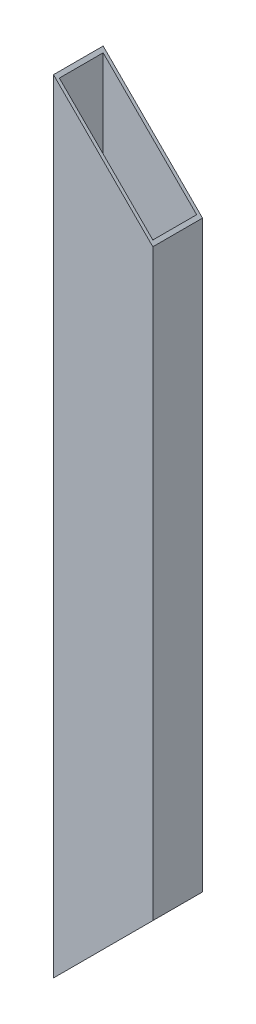
ISO-10303-21;
HEADER;
FILE_DESCRIPTION(('STEP AP214'),'2;1');
FILE_NAME('part.step','',(''),(''),'','','');
FILE_SCHEMA(('AUTOMOTIVE_DESIGN { 1 0 10303 214 1 1 1 1 }'));
ENDSEC;
DATA;
#1=APPLICATION_CONTEXT('core data for automotive mechanical design processes');
#2=APPLICATION_PROTOCOL_DEFINITION('international standard','automotive_design',2000,#1);
#3=PRODUCT_CONTEXT('',#1,'mechanical');
#4=PRODUCT('Part','Part','',(#3));
#5=PRODUCT_RELATED_PRODUCT_CATEGORY('part','',(#4));
#6=PRODUCT_DEFINITION_FORMATION('','',#4);
#7=PRODUCT_DEFINITION_CONTEXT('part definition',#1,'design');
#8=PRODUCT_DEFINITION('design','',#6,#7);
#9=PRODUCT_DEFINITION_SHAPE('','',#8);
#10=(LENGTH_UNIT() NAMED_UNIT(*) SI_UNIT(.MILLI.,.METRE.));
#11=(NAMED_UNIT(*) PLANE_ANGLE_UNIT() SI_UNIT($,.RADIAN.));
#12=(NAMED_UNIT(*) SI_UNIT($,.STERADIAN.) SOLID_ANGLE_UNIT());
#13=UNCERTAINTY_MEASURE_WITH_UNIT(LENGTH_MEASURE(1.E-05),#10,'distance_accuracy_value','');
#14=(GEOMETRIC_REPRESENTATION_CONTEXT(3) GLOBAL_UNCERTAINTY_ASSIGNED_CONTEXT((#13)) GLOBAL_UNIT_ASSIGNED_CONTEXT((#10,
#11,#12)) REPRESENTATION_CONTEXT('',''));
#15=CARTESIAN_POINT('',(0.,0.,0.));
#16=DIRECTION('',(0.,0.,1.));
#17=DIRECTION('',(1.,0.,0.));
#18=AXIS2_PLACEMENT_3D('',#15,#16,#17);
#19=CARTESIAN_POINT('',(25.4,400.,12.7));
#20=DIRECTION('',(-1.,0.,0.));
#21=DIRECTION('',(0.,0.,1.));
#22=AXIS2_PLACEMENT_3D('',#19,#20,#21);
#23=PLANE('',#22);
#24=DIRECTION('',(0.,-1.,0.));
#25=VECTOR('',#24,1.);
#26=CARTESIAN_POINT('',(25.4,400.,-12.7));
#27=LINE('',#26,#25);
#28=CARTESIAN_POINT('',(25.4,349.2,-12.7));
#29=VERTEX_POINT('',#28);
#30=CARTESIAN_POINT('',(25.4,50.8000000000002,-12.7));
#31=VERTEX_POINT('',#30);
#32=EDGE_CURVE('E107',#29,#31,#27,.T.);
#33=ORIENTED_EDGE('',*,*,#32,.F.);
#34=DIRECTION('',(0.,0.,1.));
#35=VECTOR('',#34,1.);
#36=CARTESIAN_POINT('',(25.4,349.2,-13.3));
#37=LINE('',#36,#35);
#38=CARTESIAN_POINT('',(25.4,349.2,12.7));
#39=VERTEX_POINT('',#38);
#40=EDGE_CURVE('E98',#29,#39,#37,.T.);
#41=ORIENTED_EDGE('',*,*,#40,.T.);
#42=DIRECTION('',(0.,-1.,0.));
#43=VECTOR('',#42,1.);
#44=CARTESIAN_POINT('',(25.4,400.,12.7));
#45=LINE('',#44,#43);
#46=CARTESIAN_POINT('',(25.4,50.8000000000002,12.7));
#47=VERTEX_POINT('',#46);
#48=EDGE_CURVE('E53',#39,#47,#45,.T.);
#49=ORIENTED_EDGE('',*,*,#48,.T.);
#50=DIRECTION('',(0.,0.,1.));
#51=VECTOR('',#50,1.);
#52=CARTESIAN_POINT('',(25.4,50.8000000000002,-13.3));
#53=LINE('',#52,#51);
#54=EDGE_CURVE('E166',#31,#47,#53,.T.);
#55=ORIENTED_EDGE('',*,*,#54,.F.);
#56=EDGE_LOOP('',(#33,#41,#49,#55));
#57=FACE_BOUND('',#56,.T.);
#58=ADVANCED_FACE('F32',(#57),#23,.F.);
#59=CARTESIAN_POINT('',(-25.4,400.,-12.7));
#60=DIRECTION('',(0.,0.,1.));
#61=DIRECTION('',(1.,0.,0.));
#62=AXIS2_PLACEMENT_3D('',#59,#60,#61);
#63=PLANE('',#62);
#64=DIRECTION('',(0.,-1.,0.));
#65=VECTOR('',#64,1.);
#66=CARTESIAN_POINT('',(-25.4,400.,-12.7));
#67=LINE('',#66,#65);
#68=CARTESIAN_POINT('',(-25.4,400.,-12.7));
#69=VERTEX_POINT('',#68);
#70=CARTESIAN_POINT('',(-25.4,0.,-12.7));
#71=VERTEX_POINT('',#70);
#72=EDGE_CURVE('E115',#69,#71,#67,.T.);
#73=ORIENTED_EDGE('',*,*,#72,.F.);
#74=DIRECTION('',(0.707106781186546,-0.707106781186549,0.));
#75=VECTOR('',#74,1.);
#76=CARTESIAN_POINT('',(-25.4,400.,-12.7));
#77=LINE('',#76,#75);
#78=EDGE_CURVE('E164',#69,#29,#77,.T.);
#79=ORIENTED_EDGE('',*,*,#78,.T.);
#80=ORIENTED_EDGE('',*,*,#32,.T.);
#81=DIRECTION('',(-0.707106781186546,-0.707106781186549,0.));
#82=VECTOR('',#81,1.);
#83=CARTESIAN_POINT('',(174.6,200.000000000001,-12.7));
#84=LINE('',#83,#82);
#85=EDGE_CURVE('E144',#31,#71,#84,.T.);
#86=ORIENTED_EDGE('',*,*,#85,.T.);
#87=EDGE_LOOP('',(#73,#79,#80,#86));
#88=FACE_BOUND('',#87,.T.);
#89=ADVANCED_FACE('F163',(#88),#63,.F.);
#90=CARTESIAN_POINT('',(-25.4,400.,12.7));
#91=DIRECTION('',(1.,0.,0.));
#92=DIRECTION('',(0.,0.,-1.));
#93=AXIS2_PLACEMENT_3D('',#90,#91,#92);
#94=PLANE('',#93);
#95=DIRECTION('',(0.,0.,1.));
#96=VECTOR('',#95,1.);
#97=CARTESIAN_POINT('',(-25.4,0.,12.7));
#98=LINE('',#97,#96);
#99=CARTESIAN_POINT('',(-25.4,0.,12.7));
#100=VERTEX_POINT('',#99);
#101=EDGE_CURVE('E117',#71,#100,#98,.T.);
#102=ORIENTED_EDGE('',*,*,#101,.T.);
#103=DIRECTION('',(0.,-1.,0.));
#104=VECTOR('',#103,1.);
#105=CARTESIAN_POINT('',(-25.4,400.,12.7));
#106=LINE('',#105,#104);
#107=CARTESIAN_POINT('',(-25.4,400.,12.7));
#108=VERTEX_POINT('',#107);
#109=EDGE_CURVE('E113',#108,#100,#106,.T.);
#110=ORIENTED_EDGE('',*,*,#109,.F.);
#111=DIRECTION('',(0.,0.,1.));
#112=VECTOR('',#111,1.);
#113=CARTESIAN_POINT('',(-25.4,400.,12.7));
#114=LINE('',#113,#112);
#115=EDGE_CURVE('E101',#69,#108,#114,.T.);
#116=ORIENTED_EDGE('',*,*,#115,.F.);
#117=ORIENTED_EDGE('',*,*,#72,.T.);
#118=EDGE_LOOP('',(#102,#110,#116,#117));
#119=FACE_BOUND('',#118,.T.);
#120=ADVANCED_FACE('F159',(#119),#94,.F.);
#121=CARTESIAN_POINT('',(-25.4,400.,12.7));
#122=DIRECTION('',(0.,0.,-1.));
#123=DIRECTION('',(-1.,0.,0.));
#124=AXIS2_PLACEMENT_3D('',#121,#122,#123);
#125=PLANE('',#124);
#126=ORIENTED_EDGE('',*,*,#48,.F.);
#127=DIRECTION('',(0.707106781186546,-0.707106781186549,0.));
#128=VECTOR('',#127,1.);
#129=CARTESIAN_POINT('',(-25.4,400.,12.7));
#130=LINE('',#129,#128);
#131=EDGE_CURVE('E96',#108,#39,#130,.T.);
#132=ORIENTED_EDGE('',*,*,#131,.F.);
#133=ORIENTED_EDGE('',*,*,#109,.T.);
#134=DIRECTION('',(-0.707106781186546,-0.707106781186549,0.));
#135=VECTOR('',#134,1.);
#136=CARTESIAN_POINT('',(-25.4,0.,12.7));
#137=LINE('',#136,#135);
#138=EDGE_CURVE('E112',#47,#100,#137,.T.);
#139=ORIENTED_EDGE('',*,*,#138,.F.);
#140=EDGE_LOOP('',(#126,#132,#133,#139));
#141=FACE_BOUND('',#140,.T.);
#142=ADVANCED_FACE('F111',(#141),#125,.F.);
#143=CARTESIAN_POINT('',(-23.9,400.,11.2));
#144=DIRECTION('',(1.,0.,0.));
#145=DIRECTION('',(0.,0.,-1.));
#146=AXIS2_PLACEMENT_3D('',#143,#144,#145);
#147=PLANE('',#146);
#148=DIRECTION('',(0.,0.,-1.));
#149=VECTOR('',#148,1.);
#150=CARTESIAN_POINT('',(-23.9,398.5,11.2));
#151=LINE('',#150,#149);
#152=CARTESIAN_POINT('',(-23.9,398.5,11.2));
#153=VERTEX_POINT('',#152);
#154=CARTESIAN_POINT('',(-23.9,398.5,-11.2));
#155=VERTEX_POINT('',#154);
#156=EDGE_CURVE('E45',#153,#155,#151,.T.);
#157=ORIENTED_EDGE('',*,*,#156,.F.);
#158=DIRECTION('',(0.,-1.,0.));
#159=VECTOR('',#158,1.);
#160=CARTESIAN_POINT('',(-23.9,400.,11.2));
#161=LINE('',#160,#159);
#162=CARTESIAN_POINT('',(-23.9,1.50000000000003,11.2));
#163=VERTEX_POINT('',#162);
#164=EDGE_CURVE('E143',#153,#163,#161,.T.);
#165=ORIENTED_EDGE('',*,*,#164,.T.);
#166=DIRECTION('',(0.,0.,1.));
#167=VECTOR('',#166,1.);
#168=CARTESIAN_POINT('',(-23.9,1.5,11.2));
#169=LINE('',#168,#167);
#170=CARTESIAN_POINT('',(-23.9,1.50000000000003,-11.2));
#171=VERTEX_POINT('',#170);
#172=EDGE_CURVE('E132',#171,#163,#169,.T.);
#173=ORIENTED_EDGE('',*,*,#172,.F.);
#174=DIRECTION('',(0.,-1.,0.));
#175=VECTOR('',#174,1.);
#176=CARTESIAN_POINT('',(-23.9,400.,-11.2));
#177=LINE('',#176,#175);
#178=EDGE_CURVE('E141',#155,#171,#177,.T.);
#179=ORIENTED_EDGE('',*,*,#178,.F.);
#180=EDGE_LOOP('',(#157,#165,#173,#179));
#181=FACE_BOUND('',#180,.T.);
#182=ADVANCED_FACE('F140',(#181),#147,.T.);
#183=CARTESIAN_POINT('',(-23.9,400.,11.2));
#184=DIRECTION('',(0.,0.,-1.));
#185=DIRECTION('',(-1.,0.,0.));
#186=AXIS2_PLACEMENT_3D('',#183,#184,#185);
#187=PLANE('',#186);
#188=DIRECTION('',(-0.707106781186546,0.707106781186549,0.));
#189=VECTOR('',#188,1.);
#190=CARTESIAN_POINT('',(-24.65,399.25,11.2));
#191=LINE('',#190,#189);
#192=CARTESIAN_POINT('',(23.9,350.7,11.2));
#193=VERTEX_POINT('',#192);
#194=EDGE_CURVE('E168',#193,#153,#191,.T.);
#195=ORIENTED_EDGE('',*,*,#194,.F.);
#196=DIRECTION('',(0.,-1.,0.));
#197=VECTOR('',#196,1.);
#198=CARTESIAN_POINT('',(23.9,400.,11.2));
#199=LINE('',#198,#197);
#200=CARTESIAN_POINT('',(23.9,49.3000000000002,11.2));
#201=VERTEX_POINT('',#200);
#202=EDGE_CURVE('E155',#193,#201,#199,.T.);
#203=ORIENTED_EDGE('',*,*,#202,.T.);
#204=DIRECTION('',(0.707106781186546,0.707106781186549,0.));
#205=VECTOR('',#204,1.);
#206=CARTESIAN_POINT('',(175.35,200.750000000001,11.2));
#207=LINE('',#206,#205);
#208=EDGE_CURVE('E145',#163,#201,#207,.T.);
#209=ORIENTED_EDGE('',*,*,#208,.F.);
#210=ORIENTED_EDGE('',*,*,#164,.F.);
#211=EDGE_LOOP('',(#195,#203,#209,#210));
#212=FACE_BOUND('',#211,.T.);
#213=ADVANCED_FACE('F178',(#212),#187,.T.);
#214=CARTESIAN_POINT('',(23.9,400.,11.2));
#215=DIRECTION('',(-1.,0.,0.));
#216=DIRECTION('',(0.,0.,1.));
#217=AXIS2_PLACEMENT_3D('',#214,#215,#216);
#218=PLANE('',#217);
#219=DIRECTION('',(0.,0.,1.));
#220=VECTOR('',#219,1.);
#221=CARTESIAN_POINT('',(23.9,350.7,11.2));
#222=LINE('',#221,#220);
#223=CARTESIAN_POINT('',(23.9,350.7,-11.2));
#224=VERTEX_POINT('',#223);
#225=EDGE_CURVE('E108',#224,#193,#222,.T.);
#226=ORIENTED_EDGE('',*,*,#225,.F.);
#227=DIRECTION('',(0.,-1.,0.));
#228=VECTOR('',#227,1.);
#229=CARTESIAN_POINT('',(23.9,400.,-11.2));
#230=LINE('',#229,#228);
#231=CARTESIAN_POINT('',(23.9,49.3000000000003,-11.2));
#232=VERTEX_POINT('',#231);
#233=EDGE_CURVE('E153',#224,#232,#230,.T.);
#234=ORIENTED_EDGE('',*,*,#233,.T.);
#235=DIRECTION('',(0.,0.,-1.));
#236=VECTOR('',#235,1.);
#237=CARTESIAN_POINT('',(23.9,49.3000000000002,11.2));
#238=LINE('',#237,#236);
#239=EDGE_CURVE('E135',#201,#232,#238,.T.);
#240=ORIENTED_EDGE('',*,*,#239,.F.);
#241=ORIENTED_EDGE('',*,*,#202,.F.);
#242=EDGE_LOOP('',(#226,#234,#240,#241));
#243=FACE_BOUND('',#242,.T.);
#244=ADVANCED_FACE('F179',(#243),#218,.T.);
#245=CARTESIAN_POINT('',(-23.9,400.,-11.2));
#246=DIRECTION('',(0.,0.,1.));
#247=DIRECTION('',(1.,0.,0.));
#248=AXIS2_PLACEMENT_3D('',#245,#246,#247);
#249=PLANE('',#248);
#250=DIRECTION('',(0.707106781186546,-0.707106781186549,0.));
#251=VECTOR('',#250,1.);
#252=CARTESIAN_POINT('',(-24.65,399.25,-11.2));
#253=LINE('',#252,#251);
#254=EDGE_CURVE('E11',#155,#224,#253,.T.);
#255=ORIENTED_EDGE('',*,*,#254,.F.);
#256=ORIENTED_EDGE('',*,*,#178,.T.);
#257=DIRECTION('',(-0.707106781186546,-0.707106781186549,0.));
#258=VECTOR('',#257,1.);
#259=CARTESIAN_POINT('',(175.35,200.750000000001,-11.2));
#260=LINE('',#259,#258);
#261=EDGE_CURVE('E39',#232,#171,#260,.T.);
#262=ORIENTED_EDGE('',*,*,#261,.F.);
#263=ORIENTED_EDGE('',*,*,#233,.F.);
#264=EDGE_LOOP('',(#255,#256,#262,#263));
#265=FACE_BOUND('',#264,.T.);
#266=ADVANCED_FACE('F180',(#265),#249,.T.);
#267=CARTESIAN_POINT('',(-25.4,0.,-13.3));
#268=DIRECTION('',(-0.707106781186549,0.707106781186546,0.));
#269=DIRECTION('',(-0.707106781186546,-0.707106781186549,0.));
#270=AXIS2_PLACEMENT_3D('',#267,#268,#269);
#271=PLANE('',#270);
#272=ORIENTED_EDGE('',*,*,#172,.T.);
#273=ORIENTED_EDGE('',*,*,#208,.T.);
#274=ORIENTED_EDGE('',*,*,#239,.T.);
#275=ORIENTED_EDGE('',*,*,#261,.T.);
#276=EDGE_LOOP('',(#272,#273,#274,#275));
#277=FACE_BOUND('',#276,.T.);
#278=ORIENTED_EDGE('',*,*,#54,.T.);
#279=ORIENTED_EDGE('',*,*,#138,.T.);
#280=ORIENTED_EDGE('',*,*,#101,.F.);
#281=ORIENTED_EDGE('',*,*,#85,.F.);
#282=EDGE_LOOP('',(#278,#279,#280,#281));
#283=FACE_BOUND('',#282,.T.);
#284=ADVANCED_FACE('F129',(#277,#283),#271,.F.);
#285=CARTESIAN_POINT('',(-25.4,400.,-13.3));
#286=DIRECTION('',(-0.707106781186549,-0.707106781186546,0.));
#287=DIRECTION('',(0.707106781186546,-0.707106781186549,0.));
#288=AXIS2_PLACEMENT_3D('',#285,#286,#287);
#289=PLANE('',#288);
#290=ORIENTED_EDGE('',*,*,#156,.T.);
#291=ORIENTED_EDGE('',*,*,#254,.T.);
#292=ORIENTED_EDGE('',*,*,#225,.T.);
#293=ORIENTED_EDGE('',*,*,#194,.T.);
#294=EDGE_LOOP('',(#290,#291,#292,#293));
#295=FACE_BOUND('',#294,.T.);
#296=ORIENTED_EDGE('',*,*,#115,.T.);
#297=ORIENTED_EDGE('',*,*,#131,.T.);
#298=ORIENTED_EDGE('',*,*,#40,.F.);
#299=ORIENTED_EDGE('',*,*,#78,.F.);
#300=EDGE_LOOP('',(#296,#297,#298,#299));
#301=FACE_BOUND('',#300,.T.);
#302=ADVANCED_FACE('F97',(#295,#301),#289,.F.);
#303=CLOSED_SHELL('',(#58,#89,#120,#142,#182,#213,#244,#266,#284,#302));
#304=MANIFOLD_SOLID_BREP('B2',#303);
#305=ADVANCED_BREP_SHAPE_REPRESENTATION('',(#18,#304),#14);
#306=SHAPE_DEFINITION_REPRESENTATION(#9,#305);
ENDSEC;
END-ISO-10303-21;
